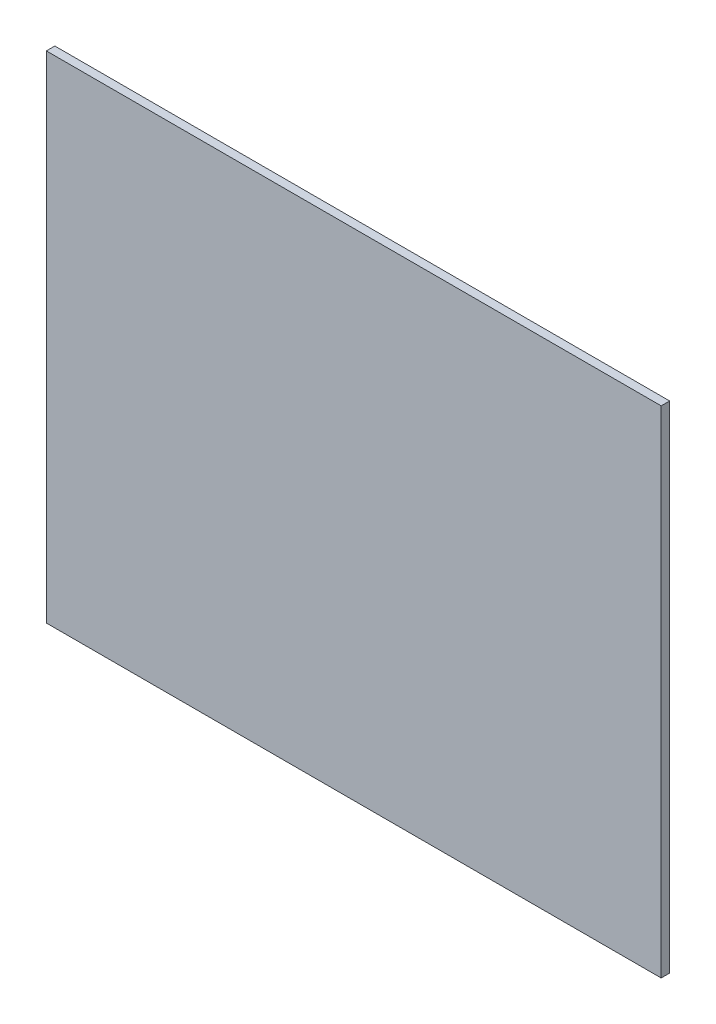
ISO-10303-21;
HEADER;
FILE_DESCRIPTION(('STEP AP214'),'2;1');
FILE_NAME('part.step','',(''),(''),'','','');
FILE_SCHEMA(('AUTOMOTIVE_DESIGN { 1 0 10303 214 1 1 1 1 }'));
ENDSEC;
DATA;
#1=APPLICATION_CONTEXT('core data for automotive mechanical design processes');
#2=APPLICATION_PROTOCOL_DEFINITION('international standard','automotive_design',2000,#1);
#3=PRODUCT_CONTEXT('',#1,'mechanical');
#4=PRODUCT('Part','Part','',(#3));
#5=PRODUCT_RELATED_PRODUCT_CATEGORY('part','',(#4));
#6=PRODUCT_DEFINITION_FORMATION('','',#4);
#7=PRODUCT_DEFINITION_CONTEXT('part definition',#1,'design');
#8=PRODUCT_DEFINITION('design','',#6,#7);
#9=PRODUCT_DEFINITION_SHAPE('','',#8);
#10=(LENGTH_UNIT() NAMED_UNIT(*) SI_UNIT(.MILLI.,.METRE.));
#11=(NAMED_UNIT(*) PLANE_ANGLE_UNIT() SI_UNIT($,.RADIAN.));
#12=(NAMED_UNIT(*) SI_UNIT($,.STERADIAN.) SOLID_ANGLE_UNIT());
#13=UNCERTAINTY_MEASURE_WITH_UNIT(LENGTH_MEASURE(1.E-05),#10,'distance_accuracy_value','');
#14=(GEOMETRIC_REPRESENTATION_CONTEXT(3) GLOBAL_UNCERTAINTY_ASSIGNED_CONTEXT((#13)) GLOBAL_UNIT_ASSIGNED_CONTEXT((#10,
#11,#12)) REPRESENTATION_CONTEXT('',''));
#15=CARTESIAN_POINT('',(0.,0.,0.));
#16=DIRECTION('',(0.,0.,1.));
#17=DIRECTION('',(1.,0.,0.));
#18=AXIS2_PLACEMENT_3D('',#15,#16,#17);
#19=CARTESIAN_POINT('',(157.5816,-127.,4.3434));
#20=DIRECTION('',(-1.,0.,0.));
#21=DIRECTION('',(0.,0.,1.));
#22=AXIS2_PLACEMENT_3D('',#19,#20,#21);
#23=PLANE('',#22);
#24=DIRECTION('',(0.,1.,0.));
#25=VECTOR('',#24,1.);
#26=CARTESIAN_POINT('',(157.5816,-127.,0.));
#27=LINE('',#26,#25);
#28=CARTESIAN_POINT('',(157.5816,-127.,0.));
#29=VERTEX_POINT('',#28);
#30=CARTESIAN_POINT('',(157.5816,127.,0.));
#31=VERTEX_POINT('',#30);
#32=EDGE_CURVE('E96',#29,#31,#27,.T.);
#33=ORIENTED_EDGE('',*,*,#32,.T.);
#34=DIRECTION('',(0.,0.,-1.));
#35=VECTOR('',#34,1.);
#36=CARTESIAN_POINT('',(157.5816,127.,4.3434));
#37=LINE('',#36,#35);
#38=CARTESIAN_POINT('',(157.5816,127.,4.3434));
#39=VERTEX_POINT('',#38);
#40=EDGE_CURVE('E11',#39,#31,#37,.T.);
#41=ORIENTED_EDGE('',*,*,#40,.F.);
#42=DIRECTION('',(0.,1.,0.));
#43=VECTOR('',#42,1.);
#44=CARTESIAN_POINT('',(157.5816,-127.,4.3434));
#45=LINE('',#44,#43);
#46=CARTESIAN_POINT('',(157.5816,-127.,4.3434));
#47=VERTEX_POINT('',#46);
#48=EDGE_CURVE('E84',#47,#39,#45,.T.);
#49=ORIENTED_EDGE('',*,*,#48,.F.);
#50=DIRECTION('',(0.,0.,-1.));
#51=VECTOR('',#50,1.);
#52=CARTESIAN_POINT('',(157.5816,-127.,4.3434));
#53=LINE('',#52,#51);
#54=EDGE_CURVE('E92',#47,#29,#53,.T.);
#55=ORIENTED_EDGE('',*,*,#54,.T.);
#56=EDGE_LOOP('',(#33,#41,#49,#55));
#57=FACE_BOUND('',#56,.T.);
#58=ADVANCED_FACE('F33',(#57),#23,.F.);
#59=CARTESIAN_POINT('',(-157.5816,127.,4.3434));
#60=DIRECTION('',(0.,-1.,0.));
#61=DIRECTION('',(0.,0.,-1.));
#62=AXIS2_PLACEMENT_3D('',#59,#60,#61);
#63=PLANE('',#62);
#64=DIRECTION('',(-1.,0.,0.));
#65=VECTOR('',#64,1.);
#66=CARTESIAN_POINT('',(-157.5816,127.,0.));
#67=LINE('',#66,#65);
#68=CARTESIAN_POINT('',(-157.5816,127.,0.));
#69=VERTEX_POINT('',#68);
#70=EDGE_CURVE('E88',#31,#69,#67,.T.);
#71=ORIENTED_EDGE('',*,*,#70,.T.);
#72=DIRECTION('',(0.,0.,-1.));
#73=VECTOR('',#72,1.);
#74=CARTESIAN_POINT('',(-157.5816,127.,4.3434));
#75=LINE('',#74,#73);
#76=CARTESIAN_POINT('',(-157.5816,127.,4.3434));
#77=VERTEX_POINT('',#76);
#78=EDGE_CURVE('E41',#77,#69,#75,.T.);
#79=ORIENTED_EDGE('',*,*,#78,.F.);
#80=DIRECTION('',(-1.,0.,0.));
#81=VECTOR('',#80,1.);
#82=CARTESIAN_POINT('',(-157.5816,127.,4.3434));
#83=LINE('',#82,#81);
#84=EDGE_CURVE('E79',#39,#77,#83,.T.);
#85=ORIENTED_EDGE('',*,*,#84,.F.);
#86=ORIENTED_EDGE('',*,*,#40,.T.);
#87=EDGE_LOOP('',(#71,#79,#85,#86));
#88=FACE_BOUND('',#87,.T.);
#89=ADVANCED_FACE('F87',(#88),#63,.F.);
#90=CARTESIAN_POINT('',(-157.5816,-127.,4.3434));
#91=DIRECTION('',(1.,0.,0.));
#92=DIRECTION('',(0.,0.,-1.));
#93=AXIS2_PLACEMENT_3D('',#90,#91,#92);
#94=PLANE('',#93);
#95=DIRECTION('',(0.,-1.,0.));
#96=VECTOR('',#95,1.);
#97=CARTESIAN_POINT('',(-157.5816,-127.,0.));
#98=LINE('',#97,#96);
#99=CARTESIAN_POINT('',(-157.5816,-127.,0.));
#100=VERTEX_POINT('',#99);
#101=EDGE_CURVE('E66',#69,#100,#98,.T.);
#102=ORIENTED_EDGE('',*,*,#101,.T.);
#103=DIRECTION('',(0.,0.,-1.));
#104=VECTOR('',#103,1.);
#105=CARTESIAN_POINT('',(-157.5816,-127.,4.3434));
#106=LINE('',#105,#104);
#107=CARTESIAN_POINT('',(-157.5816,-127.,4.3434));
#108=VERTEX_POINT('',#107);
#109=EDGE_CURVE('E89',#108,#100,#106,.T.);
#110=ORIENTED_EDGE('',*,*,#109,.F.);
#111=DIRECTION('',(0.,-1.,0.));
#112=VECTOR('',#111,1.);
#113=CARTESIAN_POINT('',(-157.5816,-127.,4.3434));
#114=LINE('',#113,#112);
#115=EDGE_CURVE('E82',#77,#108,#114,.T.);
#116=ORIENTED_EDGE('',*,*,#115,.F.);
#117=ORIENTED_EDGE('',*,*,#78,.T.);
#118=EDGE_LOOP('',(#102,#110,#116,#117));
#119=FACE_BOUND('',#118,.T.);
#120=ADVANCED_FACE('F90',(#119),#94,.F.);
#121=CARTESIAN_POINT('',(-157.5816,-127.,4.3434));
#122=DIRECTION('',(0.,1.,0.));
#123=DIRECTION('',(0.,0.,1.));
#124=AXIS2_PLACEMENT_3D('',#121,#122,#123);
#125=PLANE('',#124);
#126=DIRECTION('',(1.,0.,0.));
#127=VECTOR('',#126,1.);
#128=CARTESIAN_POINT('',(-157.5816,-127.,0.));
#129=LINE('',#128,#127);
#130=EDGE_CURVE('E72',#100,#29,#129,.T.);
#131=ORIENTED_EDGE('',*,*,#130,.T.);
#132=ORIENTED_EDGE('',*,*,#54,.F.);
#133=DIRECTION('',(1.,0.,0.));
#134=VECTOR('',#133,1.);
#135=CARTESIAN_POINT('',(-157.5816,-127.,4.3434));
#136=LINE('',#135,#134);
#137=EDGE_CURVE('E49',#108,#47,#136,.T.);
#138=ORIENTED_EDGE('',*,*,#137,.F.);
#139=ORIENTED_EDGE('',*,*,#109,.T.);
#140=EDGE_LOOP('',(#131,#132,#138,#139));
#141=FACE_BOUND('',#140,.T.);
#142=ADVANCED_FACE('F103',(#141),#125,.F.);
#143=CARTESIAN_POINT('',(0.,0.,4.3434));
#144=DIRECTION('',(0.,0.,-1.));
#145=DIRECTION('',(-1.,0.,0.));
#146=AXIS2_PLACEMENT_3D('',#143,#144,#145);
#147=PLANE('',#146);
#148=ORIENTED_EDGE('',*,*,#48,.T.);
#149=ORIENTED_EDGE('',*,*,#84,.T.);
#150=ORIENTED_EDGE('',*,*,#115,.T.);
#151=ORIENTED_EDGE('',*,*,#137,.T.);
#152=EDGE_LOOP('',(#148,#149,#150,#151));
#153=FACE_BOUND('',#152,.T.);
#154=ADVANCED_FACE('F80',(#153),#147,.F.);
#155=CARTESIAN_POINT('',(0.,0.,0.));
#156=DIRECTION('',(0.,0.,-1.));
#157=DIRECTION('',(-1.,0.,0.));
#158=AXIS2_PLACEMENT_3D('',#155,#156,#157);
#159=PLANE('',#158);
#160=ORIENTED_EDGE('',*,*,#32,.F.);
#161=ORIENTED_EDGE('',*,*,#130,.F.);
#162=ORIENTED_EDGE('',*,*,#101,.F.);
#163=ORIENTED_EDGE('',*,*,#70,.F.);
#164=EDGE_LOOP('',(#160,#161,#162,#163));
#165=FACE_BOUND('',#164,.T.);
#166=ADVANCED_FACE('F106',(#165),#159,.T.);
#167=CLOSED_SHELL('',(#58,#89,#120,#142,#154,#166));
#168=MANIFOLD_SOLID_BREP('B2',#167);
#169=ADVANCED_BREP_SHAPE_REPRESENTATION('',(#18,#168),#14);
#170=SHAPE_DEFINITION_REPRESENTATION(#9,#169);
ENDSEC;
END-ISO-10303-21;
